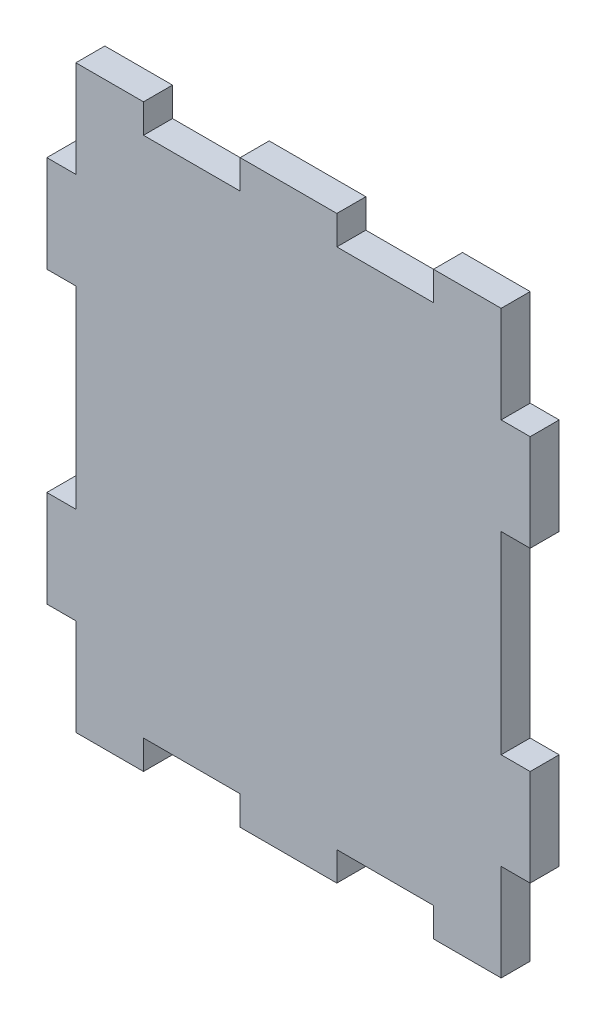
ISO-10303-21;
HEADER;
FILE_DESCRIPTION(('STEP AP214'),'2;1');
FILE_NAME('part.step','',(''),(''),'','','');
FILE_SCHEMA(('AUTOMOTIVE_DESIGN { 1 0 10303 214 1 1 1 1 }'));
ENDSEC;
DATA;
#1=APPLICATION_CONTEXT('core data for automotive mechanical design processes');
#2=APPLICATION_PROTOCOL_DEFINITION('international standard','automotive_design',2000,#1);
#3=PRODUCT_CONTEXT('',#1,'mechanical');
#4=PRODUCT('Part','Part','',(#3));
#5=PRODUCT_RELATED_PRODUCT_CATEGORY('part','',(#4));
#6=PRODUCT_DEFINITION_FORMATION('','',#4);
#7=PRODUCT_DEFINITION_CONTEXT('part definition',#1,'design');
#8=PRODUCT_DEFINITION('design','',#6,#7);
#9=PRODUCT_DEFINITION_SHAPE('','',#8);
#10=(LENGTH_UNIT() NAMED_UNIT(*) SI_UNIT(.MILLI.,.METRE.));
#11=(NAMED_UNIT(*) PLANE_ANGLE_UNIT() SI_UNIT($,.RADIAN.));
#12=(NAMED_UNIT(*) SI_UNIT($,.STERADIAN.) SOLID_ANGLE_UNIT());
#13=UNCERTAINTY_MEASURE_WITH_UNIT(LENGTH_MEASURE(1.E-05),#10,'distance_accuracy_value','');
#14=(GEOMETRIC_REPRESENTATION_CONTEXT(3) GLOBAL_UNCERTAINTY_ASSIGNED_CONTEXT((#13)) GLOBAL_UNIT_ASSIGNED_CONTEXT((#10,
#11,#12)) REPRESENTATION_CONTEXT('',''));
#15=CARTESIAN_POINT('',(0.,0.,0.));
#16=DIRECTION('',(0.,0.,1.));
#17=DIRECTION('',(1.,0.,0.));
#18=AXIS2_PLACEMENT_3D('',#15,#16,#17);
#19=CARTESIAN_POINT('',(25.,-30.,3.));
#20=DIRECTION('',(-1.,0.,0.));
#21=DIRECTION('',(0.,0.,1.));
#22=AXIS2_PLACEMENT_3D('',#19,#20,#21);
#23=PLANE('',#22);
#24=DIRECTION('',(0.,1.,0.));
#25=VECTOR('',#24,1.);
#26=CARTESIAN_POINT('',(25.,-30.,3.));
#27=LINE('',#26,#25);
#28=CARTESIAN_POINT('',(24.9999999999999,-20.,2.99999999999995));
#29=VERTEX_POINT('',#28);
#30=CARTESIAN_POINT('',(24.9999999999999,-10.,2.99999999999992));
#31=VERTEX_POINT('',#30);
#32=EDGE_CURVE('E318',#29,#31,#27,.T.);
#33=ORIENTED_EDGE('',*,*,#32,.F.);
#34=DIRECTION('',(0.,0.,-1.));
#35=VECTOR('',#34,1.);
#36=CARTESIAN_POINT('',(24.9999999999999,-20.0000000000001,0.));
#37=LINE('',#36,#35);
#38=CARTESIAN_POINT('',(24.9999999999999,-20.0000000000001,0.));
#39=VERTEX_POINT('',#38);
#40=EDGE_CURVE('E519',#29,#39,#37,.T.);
#41=ORIENTED_EDGE('',*,*,#40,.T.);
#42=DIRECTION('',(0.,1.,0.));
#43=VECTOR('',#42,1.);
#44=CARTESIAN_POINT('',(25.,-30.,0.));
#45=LINE('',#44,#43);
#46=CARTESIAN_POINT('',(24.9999999999999,-10.,0.));
#47=VERTEX_POINT('',#46);
#48=EDGE_CURVE('E331',#39,#47,#45,.T.);
#49=ORIENTED_EDGE('',*,*,#48,.T.);
#50=DIRECTION('',(0.,0.,1.));
#51=VECTOR('',#50,1.);
#52=CARTESIAN_POINT('',(24.9999999999999,-10.,0.));
#53=LINE('',#52,#51);
#54=EDGE_CURVE('E497',#47,#31,#53,.T.);
#55=ORIENTED_EDGE('',*,*,#54,.T.);
#56=EDGE_LOOP('',(#33,#41,#49,#55));
#57=FACE_BOUND('',#56,.T.);
#58=ADVANCED_FACE('F37',(#57),#23,.F.);
#59=CARTESIAN_POINT('',(-25.,30.,3.));
#60=DIRECTION('',(0.,-1.,0.));
#61=DIRECTION('',(0.,0.,-1.));
#62=AXIS2_PLACEMENT_3D('',#59,#60,#61);
#63=PLANE('',#62);
#64=DIRECTION('',(0.,0.,1.));
#65=VECTOR('',#64,1.);
#66=CARTESIAN_POINT('',(22.0000000000001,30.0000000000001,49.9999999999998));
#67=LINE('',#66,#65);
#68=CARTESIAN_POINT('',(21.9999999999999,29.9999999999999,-2.1163626406917E-13));
#69=VERTEX_POINT('',#68);
#70=CARTESIAN_POINT('',(21.9999999999999,30.,3.));
#71=VERTEX_POINT('',#70);
#72=EDGE_CURVE('E532',#69,#71,#67,.T.);
#73=ORIENTED_EDGE('',*,*,#72,.F.);
#74=DIRECTION('',(-1.,0.,0.));
#75=VECTOR('',#74,1.);
#76=CARTESIAN_POINT('',(-25.,30.,0.));
#77=LINE('',#76,#75);
#78=CARTESIAN_POINT('',(15.,30.,0.));
#79=VERTEX_POINT('',#78);
#80=EDGE_CURVE('E335',#69,#79,#77,.T.);
#81=ORIENTED_EDGE('',*,*,#80,.T.);
#82=DIRECTION('',(0.,0.,-1.));
#83=VECTOR('',#82,1.);
#84=CARTESIAN_POINT('',(15.,30.,0.));
#85=LINE('',#84,#83);
#86=CARTESIAN_POINT('',(15.,30.,3.));
#87=VERTEX_POINT('',#86);
#88=EDGE_CURVE('E381',#87,#79,#85,.T.);
#89=ORIENTED_EDGE('',*,*,#88,.F.);
#90=DIRECTION('',(-1.,0.,0.));
#91=VECTOR('',#90,1.);
#92=CARTESIAN_POINT('',(-25.,30.,3.));
#93=LINE('',#92,#91);
#94=EDGE_CURVE('E323',#71,#87,#93,.T.);
#95=ORIENTED_EDGE('',*,*,#94,.F.);
#96=EDGE_LOOP('',(#73,#81,#89,#95));
#97=FACE_BOUND('',#96,.T.);
#98=ADVANCED_FACE('F537',(#97),#63,.F.);
#99=DIRECTION('',(0.,0.,1.));
#100=VECTOR('',#99,1.);
#101=CARTESIAN_POINT('',(5.,30.,0.));
#102=LINE('',#101,#100);
#103=CARTESIAN_POINT('',(5.,30.,0.));
#104=VERTEX_POINT('',#103);
#105=CARTESIAN_POINT('',(5.,30.,3.));
#106=VERTEX_POINT('',#105);
#107=EDGE_CURVE('E357',#104,#106,#102,.T.);
#108=ORIENTED_EDGE('',*,*,#107,.F.);
#109=CARTESIAN_POINT('',(-5.,30.,0.));
#110=VERTEX_POINT('',#109);
#111=EDGE_CURVE('E334',#104,#110,#77,.T.);
#112=ORIENTED_EDGE('',*,*,#111,.T.);
#113=DIRECTION('',(0.,0.,-1.));
#114=VECTOR('',#113,1.);
#115=CARTESIAN_POINT('',(-5.,30.,0.));
#116=LINE('',#115,#114);
#117=CARTESIAN_POINT('',(-5.,30.,3.));
#118=VERTEX_POINT('',#117);
#119=EDGE_CURVE('E356',#118,#110,#116,.T.);
#120=ORIENTED_EDGE('',*,*,#119,.F.);
#121=EDGE_CURVE('E322',#106,#118,#93,.T.);
#122=ORIENTED_EDGE('',*,*,#121,.F.);
#123=EDGE_LOOP('',(#108,#112,#120,#122));
#124=FACE_BOUND('',#123,.T.);
#125=ADVANCED_FACE('F354',(#124),#63,.F.);
#126=DIRECTION('',(0.,0.,1.));
#127=VECTOR('',#126,1.);
#128=CARTESIAN_POINT('',(-15.,30.,0.));
#129=LINE('',#128,#127);
#130=CARTESIAN_POINT('',(-15.,30.,0.));
#131=VERTEX_POINT('',#130);
#132=CARTESIAN_POINT('',(-15.,30.,3.));
#133=VERTEX_POINT('',#132);
#134=EDGE_CURVE('E279',#131,#133,#129,.T.);
#135=ORIENTED_EDGE('',*,*,#134,.F.);
#136=CARTESIAN_POINT('',(-22.0000000000001,29.9999999999999,0.));
#137=VERTEX_POINT('',#136);
#138=EDGE_CURVE('E332',#131,#137,#77,.T.);
#139=ORIENTED_EDGE('',*,*,#138,.T.);
#140=DIRECTION('',(0.,0.,1.));
#141=VECTOR('',#140,1.);
#142=CARTESIAN_POINT('',(-21.9999999999999,30.0000000000001,49.9999999999999));
#143=LINE('',#142,#141);
#144=CARTESIAN_POINT('',(-22.0000000000001,30.,3.));
#145=VERTEX_POINT('',#144);
#146=EDGE_CURVE('E482',#137,#145,#143,.T.);
#147=ORIENTED_EDGE('',*,*,#146,.T.);
#148=EDGE_CURVE('E320',#133,#145,#93,.T.);
#149=ORIENTED_EDGE('',*,*,#148,.F.);
#150=EDGE_LOOP('',(#135,#139,#147,#149));
#151=FACE_BOUND('',#150,.T.);
#152=ADVANCED_FACE('F547',(#151),#63,.F.);
#153=CARTESIAN_POINT('',(-25.,-30.,3.));
#154=DIRECTION('',(1.,0.,0.));
#155=DIRECTION('',(0.,0.,-1.));
#156=AXIS2_PLACEMENT_3D('',#153,#154,#155);
#157=PLANE('',#156);
#158=DIRECTION('',(0.,0.,1.));
#159=VECTOR('',#158,1.);
#160=CARTESIAN_POINT('',(-25.0000000000001,20.,0.));
#161=LINE('',#160,#159);
#162=CARTESIAN_POINT('',(-25.0000000000001,20.,0.));
#163=VERTEX_POINT('',#162);
#164=CARTESIAN_POINT('',(-25.0000000000001,20.,2.99999999999998));
#165=VERTEX_POINT('',#164);
#166=EDGE_CURVE('E435',#163,#165,#161,.T.);
#167=ORIENTED_EDGE('',*,*,#166,.F.);
#168=DIRECTION('',(0.,-1.,0.));
#169=VECTOR('',#168,1.);
#170=CARTESIAN_POINT('',(-25.,-30.,0.));
#171=LINE('',#170,#169);
#172=CARTESIAN_POINT('',(-25.0000000000001,9.99999999999994,0.));
#173=VERTEX_POINT('',#172);
#174=EDGE_CURVE('E338',#163,#173,#171,.T.);
#175=ORIENTED_EDGE('',*,*,#174,.T.);
#176=DIRECTION('',(0.,0.,-1.));
#177=VECTOR('',#176,1.);
#178=CARTESIAN_POINT('',(-25.0000000000001,9.99999999999994,0.));
#179=LINE('',#178,#177);
#180=CARTESIAN_POINT('',(-25.0000000000001,9.99999999999996,3.00000000000001));
#181=VERTEX_POINT('',#180);
#182=EDGE_CURVE('E437',#181,#173,#179,.T.);
#183=ORIENTED_EDGE('',*,*,#182,.F.);
#184=DIRECTION('',(0.,-1.,0.));
#185=VECTOR('',#184,1.);
#186=CARTESIAN_POINT('',(-25.,-30.,3.));
#187=LINE('',#186,#185);
#188=EDGE_CURVE('E326',#165,#181,#187,.T.);
#189=ORIENTED_EDGE('',*,*,#188,.F.);
#190=EDGE_LOOP('',(#167,#175,#183,#189));
#191=FACE_BOUND('',#190,.T.);
#192=ADVANCED_FACE('F560',(#191),#157,.F.);
#193=DIRECTION('',(0.,0.,1.));
#194=VECTOR('',#193,1.);
#195=CARTESIAN_POINT('',(-25.0000000000001,-10.,0.));
#196=LINE('',#195,#194);
#197=CARTESIAN_POINT('',(-25.0000000000001,-10.,0.));
#198=VERTEX_POINT('',#197);
#199=CARTESIAN_POINT('',(-25.0000000000001,-10.,3.00000000000008));
#200=VERTEX_POINT('',#199);
#201=EDGE_CURVE('E471',#198,#200,#196,.T.);
#202=ORIENTED_EDGE('',*,*,#201,.F.);
#203=CARTESIAN_POINT('',(-25.0000000000001,-20.,1.14491749414469E-13));
#204=VERTEX_POINT('',#203);
#205=EDGE_CURVE('E336',#198,#204,#171,.T.);
#206=ORIENTED_EDGE('',*,*,#205,.T.);
#207=DIRECTION('',(0.,0.,-1.));
#208=VECTOR('',#207,1.);
#209=CARTESIAN_POINT('',(-25.0000000000001,-20.,1.14491749414469E-13));
#210=LINE('',#209,#208);
#211=CARTESIAN_POINT('',(-25.0000000000001,-20.,3.00000000000011));
#212=VERTEX_POINT('',#211);
#213=EDGE_CURVE('E459',#212,#204,#210,.T.);
#214=ORIENTED_EDGE('',*,*,#213,.F.);
#215=EDGE_CURVE('E324',#200,#212,#187,.T.);
#216=ORIENTED_EDGE('',*,*,#215,.F.);
#217=EDGE_LOOP('',(#202,#206,#214,#216));
#218=FACE_BOUND('',#217,.T.);
#219=ADVANCED_FACE('F581',(#218),#157,.F.);
#220=CARTESIAN_POINT('',(-25.,-30.,3.));
#221=DIRECTION('',(0.,1.,0.));
#222=DIRECTION('',(0.,0.,1.));
#223=AXIS2_PLACEMENT_3D('',#220,#221,#222);
#224=PLANE('',#223);
#225=DIRECTION('',(1.,0.,0.));
#226=VECTOR('',#225,1.);
#227=CARTESIAN_POINT('',(-25.,-30.,3.));
#228=LINE('',#227,#226);
#229=CARTESIAN_POINT('',(-22.0000000000001,-30.,3.));
#230=VERTEX_POINT('',#229);
#231=CARTESIAN_POINT('',(-15.,-30.,3.));
#232=VERTEX_POINT('',#231);
#233=EDGE_CURVE('E11',#230,#232,#228,.T.);
#234=ORIENTED_EDGE('',*,*,#233,.F.);
#235=DIRECTION('',(0.,0.,-1.));
#236=VECTOR('',#235,1.);
#237=CARTESIAN_POINT('',(-21.9999999999999,-29.9999999999999,50.0000000000001));
#238=LINE('',#237,#236);
#239=CARTESIAN_POINT('',(-22.0000000000001,-30.,1.38777878078145E-13));
#240=VERTEX_POINT('',#239);
#241=EDGE_CURVE('E450',#230,#240,#238,.T.);
#242=ORIENTED_EDGE('',*,*,#241,.T.);
#243=DIRECTION('',(1.,0.,0.));
#244=VECTOR('',#243,1.);
#245=CARTESIAN_POINT('',(-25.,-30.,0.));
#246=LINE('',#245,#244);
#247=CARTESIAN_POINT('',(-15.,-30.,0.));
#248=VERTEX_POINT('',#247);
#249=EDGE_CURVE('E319',#240,#248,#246,.T.);
#250=ORIENTED_EDGE('',*,*,#249,.T.);
#251=DIRECTION('',(0.,0.,1.));
#252=VECTOR('',#251,1.);
#253=CARTESIAN_POINT('',(-15.,-30.,0.));
#254=LINE('',#253,#252);
#255=EDGE_CURVE('E396',#248,#232,#254,.T.);
#256=ORIENTED_EDGE('',*,*,#255,.T.);
#257=EDGE_LOOP('',(#234,#242,#250,#256));
#258=FACE_BOUND('',#257,.T.);
#259=ADVANCED_FACE('F585',(#258),#224,.F.);
#260=CARTESIAN_POINT('',(-5.,-30.,3.));
#261=VERTEX_POINT('',#260);
#262=CARTESIAN_POINT('',(5.,-30.,3.));
#263=VERTEX_POINT('',#262);
#264=EDGE_CURVE('E46',#261,#263,#228,.T.);
#265=ORIENTED_EDGE('',*,*,#264,.F.);
#266=DIRECTION('',(0.,0.,-1.));
#267=VECTOR('',#266,1.);
#268=CARTESIAN_POINT('',(-5.,-30.,0.));
#269=LINE('',#268,#267);
#270=CARTESIAN_POINT('',(-5.,-30.,0.));
#271=VERTEX_POINT('',#270);
#272=EDGE_CURVE('E413',#261,#271,#269,.T.);
#273=ORIENTED_EDGE('',*,*,#272,.T.);
#274=CARTESIAN_POINT('',(5.,-30.,0.));
#275=VERTEX_POINT('',#274);
#276=EDGE_CURVE('E599',#271,#275,#246,.T.);
#277=ORIENTED_EDGE('',*,*,#276,.T.);
#278=DIRECTION('',(0.,0.,1.));
#279=VECTOR('',#278,1.);
#280=CARTESIAN_POINT('',(5.,-30.,0.));
#281=LINE('',#280,#279);
#282=EDGE_CURVE('E395',#275,#263,#281,.T.);
#283=ORIENTED_EDGE('',*,*,#282,.T.);
#284=EDGE_LOOP('',(#265,#273,#277,#283));
#285=FACE_BOUND('',#284,.T.);
#286=ADVANCED_FACE('F604',(#285),#224,.F.);
#287=CARTESIAN_POINT('',(15.,-30.,3.));
#288=VERTEX_POINT('',#287);
#289=CARTESIAN_POINT('',(21.9999999999999,-30.,3.));
#290=VERTEX_POINT('',#289);
#291=EDGE_CURVE('E48',#288,#290,#228,.T.);
#292=ORIENTED_EDGE('',*,*,#291,.F.);
#293=DIRECTION('',(0.,0.,-1.));
#294=VECTOR('',#293,1.);
#295=CARTESIAN_POINT('',(15.,-30.,0.));
#296=LINE('',#295,#294);
#297=CARTESIAN_POINT('',(15.,-30.,0.));
#298=VERTEX_POINT('',#297);
#299=EDGE_CURVE('E427',#288,#298,#296,.T.);
#300=ORIENTED_EDGE('',*,*,#299,.T.);
#301=CARTESIAN_POINT('',(21.9999999999999,-30.0000000000001,0.));
#302=VERTEX_POINT('',#301);
#303=EDGE_CURVE('E41',#298,#302,#246,.T.);
#304=ORIENTED_EDGE('',*,*,#303,.T.);
#305=DIRECTION('',(0.,0.,-1.));
#306=VECTOR('',#305,1.);
#307=CARTESIAN_POINT('',(22.0000000000001,-29.9999999999999,50.));
#308=LINE('',#307,#306);
#309=EDGE_CURVE('E503',#290,#302,#308,.T.);
#310=ORIENTED_EDGE('',*,*,#309,.F.);
#311=EDGE_LOOP('',(#292,#300,#304,#310));
#312=FACE_BOUND('',#311,.T.);
#313=ADVANCED_FACE('F622',(#312),#224,.F.);
#314=CARTESIAN_POINT('',(0.,0.,0.));
#315=DIRECTION('',(0.,0.,-1.));
#316=DIRECTION('',(-1.,0.,0.));
#317=AXIS2_PLACEMENT_3D('',#314,#315,#316);
#318=PLANE('',#317);
#319=DIRECTION('',(0.,1.,0.));
#320=VECTOR('',#319,1.);
#321=CARTESIAN_POINT('',(21.9999999999999,29.9999999999999,-2.1163626406917E-13));
#322=LINE('',#321,#320);
#323=CARTESIAN_POINT('',(21.9999999999999,19.9999999999999,-1.76941794549634E-13));
#324=VERTEX_POINT('',#323);
#325=EDGE_CURVE('E529',#324,#69,#322,.T.);
#326=ORIENTED_EDGE('',*,*,#325,.F.);
#327=DIRECTION('',(1.,0.,0.));
#328=VECTOR('',#327,1.);
#329=CARTESIAN_POINT('',(21.9999999999999,19.9999999999999,-1.76941794549634E-13));
#330=LINE('',#329,#328);
#331=CARTESIAN_POINT('',(24.9999999999999,19.9999999999999,-1.87350135405495E-13));
#332=VERTEX_POINT('',#331);
#333=EDGE_CURVE('E500',#324,#332,#330,.T.);
#334=ORIENTED_EDGE('',*,*,#333,.T.);
#335=CARTESIAN_POINT('',(24.9999999999999,9.99999999999994,-1.52655665885959E-13));
#336=VERTEX_POINT('',#335);
#337=EDGE_CURVE('E328',#336,#332,#45,.T.);
#338=ORIENTED_EDGE('',*,*,#337,.F.);
#339=DIRECTION('',(1.,0.,0.));
#340=VECTOR('',#339,1.);
#341=CARTESIAN_POINT('',(21.9999999999999,9.99999999999994,-1.42247325030098E-13));
#342=LINE('',#341,#340);
#343=CARTESIAN_POINT('',(21.9999999999999,9.99999999999994,-1.42247325030098E-13));
#344=VERTEX_POINT('',#343);
#345=EDGE_CURVE('E504',#344,#336,#342,.T.);
#346=ORIENTED_EDGE('',*,*,#345,.F.);
#347=CARTESIAN_POINT('',(21.9999999999999,-10.,0.));
#348=VERTEX_POINT('',#347);
#349=EDGE_CURVE('E533',#348,#344,#322,.T.);
#350=ORIENTED_EDGE('',*,*,#349,.F.);
#351=DIRECTION('',(1.,0.,0.));
#352=VECTOR('',#351,1.);
#353=CARTESIAN_POINT('',(21.9999999999999,-10.,0.));
#354=LINE('',#353,#352);
#355=EDGE_CURVE('E486',#348,#47,#354,.T.);
#356=ORIENTED_EDGE('',*,*,#355,.T.);
#357=ORIENTED_EDGE('',*,*,#48,.F.);
#358=DIRECTION('',(1.,0.,0.));
#359=VECTOR('',#358,1.);
#360=CARTESIAN_POINT('',(21.9999999999999,-20.0000000000001,0.));
#361=LINE('',#360,#359);
#362=CARTESIAN_POINT('',(21.9999999999999,-20.0000000000001,0.));
#363=VERTEX_POINT('',#362);
#364=EDGE_CURVE('E515',#363,#39,#361,.T.);
#365=ORIENTED_EDGE('',*,*,#364,.F.);
#366=EDGE_CURVE('E530',#302,#363,#322,.T.);
#367=ORIENTED_EDGE('',*,*,#366,.F.);
#368=ORIENTED_EDGE('',*,*,#303,.F.);
#369=DIRECTION('',(0.,-1.,0.));
#370=VECTOR('',#369,1.);
#371=CARTESIAN_POINT('',(15.,-27.,0.));
#372=LINE('',#371,#370);
#373=CARTESIAN_POINT('',(15.,-27.,0.));
#374=VERTEX_POINT('',#373);
#375=EDGE_CURVE('E399',#374,#298,#372,.T.);
#376=ORIENTED_EDGE('',*,*,#375,.F.);
#377=DIRECTION('',(1.,0.,0.));
#378=VECTOR('',#377,1.);
#379=CARTESIAN_POINT('',(-25.,-27.,0.));
#380=LINE('',#379,#378);
#381=CARTESIAN_POINT('',(5.,-27.,0.));
#382=VERTEX_POINT('',#381);
#383=EDGE_CURVE('E430',#382,#374,#380,.T.);
#384=ORIENTED_EDGE('',*,*,#383,.F.);
#385=DIRECTION('',(0.,-1.,0.));
#386=VECTOR('',#385,1.);
#387=CARTESIAN_POINT('',(5.,-27.,0.));
#388=LINE('',#387,#386);
#389=EDGE_CURVE('E402',#382,#275,#388,.T.);
#390=ORIENTED_EDGE('',*,*,#389,.T.);
#391=ORIENTED_EDGE('',*,*,#276,.F.);
#392=DIRECTION('',(0.,-1.,0.));
#393=VECTOR('',#392,1.);
#394=CARTESIAN_POINT('',(-5.,-27.,0.));
#395=LINE('',#394,#393);
#396=CARTESIAN_POINT('',(-5.,-27.,0.));
#397=VERTEX_POINT('',#396);
#398=EDGE_CURVE('E411',#397,#271,#395,.T.);
#399=ORIENTED_EDGE('',*,*,#398,.F.);
#400=CARTESIAN_POINT('',(-15.,-27.,0.));
#401=VERTEX_POINT('',#400);
#402=EDGE_CURVE('E434',#401,#397,#380,.T.);
#403=ORIENTED_EDGE('',*,*,#402,.F.);
#404=DIRECTION('',(0.,-1.,0.));
#405=VECTOR('',#404,1.);
#406=CARTESIAN_POINT('',(-15.,-27.,0.));
#407=LINE('',#406,#405);
#408=EDGE_CURVE('E389',#401,#248,#407,.T.);
#409=ORIENTED_EDGE('',*,*,#408,.T.);
#410=ORIENTED_EDGE('',*,*,#249,.F.);
#411=DIRECTION('',(0.,1.,0.));
#412=VECTOR('',#411,1.);
#413=CARTESIAN_POINT('',(-22.0000000000001,29.9999999999999,0.));
#414=LINE('',#413,#412);
#415=CARTESIAN_POINT('',(-22.0000000000001,-20.,1.04083408558608E-13));
#416=VERTEX_POINT('',#415);
#417=EDGE_CURVE('E479',#240,#416,#414,.T.);
#418=ORIENTED_EDGE('',*,*,#417,.T.);
#419=DIRECTION('',(1.,0.,0.));
#420=VECTOR('',#419,1.);
#421=CARTESIAN_POINT('',(-25.0000000000001,-20.,1.14491749414469E-13));
#422=LINE('',#421,#420);
#423=EDGE_CURVE('E463',#204,#416,#422,.T.);
#424=ORIENTED_EDGE('',*,*,#423,.F.);
#425=ORIENTED_EDGE('',*,*,#205,.F.);
#426=DIRECTION('',(1.,0.,0.));
#427=VECTOR('',#426,1.);
#428=CARTESIAN_POINT('',(-25.0000000000001,-10.,0.));
#429=LINE('',#428,#427);
#430=CARTESIAN_POINT('',(-22.0000000000001,-10.,0.));
#431=VERTEX_POINT('',#430);
#432=EDGE_CURVE('E466',#198,#431,#429,.T.);
#433=ORIENTED_EDGE('',*,*,#432,.T.);
#434=CARTESIAN_POINT('',(-22.0000000000001,9.99999999999994,0.));
#435=VERTEX_POINT('',#434);
#436=EDGE_CURVE('E483',#431,#435,#414,.T.);
#437=ORIENTED_EDGE('',*,*,#436,.T.);
#438=DIRECTION('',(1.,0.,0.));
#439=VECTOR('',#438,1.);
#440=CARTESIAN_POINT('',(-25.0000000000001,9.99999999999994,0.));
#441=LINE('',#440,#439);
#442=EDGE_CURVE('E451',#173,#435,#441,.T.);
#443=ORIENTED_EDGE('',*,*,#442,.F.);
#444=ORIENTED_EDGE('',*,*,#174,.F.);
#445=DIRECTION('',(1.,0.,0.));
#446=VECTOR('',#445,1.);
#447=CARTESIAN_POINT('',(-25.0000000000001,20.,0.));
#448=LINE('',#447,#446);
#449=CARTESIAN_POINT('',(-22.0000000000001,20.,0.));
#450=VERTEX_POINT('',#449);
#451=EDGE_CURVE('E447',#163,#450,#448,.T.);
#452=ORIENTED_EDGE('',*,*,#451,.T.);
#453=EDGE_CURVE('E478',#450,#137,#414,.T.);
#454=ORIENTED_EDGE('',*,*,#453,.T.);
#455=ORIENTED_EDGE('',*,*,#138,.F.);
#456=DIRECTION('',(0.,-1.,0.));
#457=VECTOR('',#456,1.);
#458=CARTESIAN_POINT('',(-15.,30.,0.));
#459=LINE('',#458,#457);
#460=CARTESIAN_POINT('',(-15.,27.,0.));
#461=VERTEX_POINT('',#460);
#462=EDGE_CURVE('E283',#131,#461,#459,.T.);
#463=ORIENTED_EDGE('',*,*,#462,.T.);
#464=DIRECTION('',(1.,0.,0.));
#465=VECTOR('',#464,1.);
#466=CARTESIAN_POINT('',(-25.,27.,0.));
#467=LINE('',#466,#465);
#468=CARTESIAN_POINT('',(-5.,27.,0.));
#469=VERTEX_POINT('',#468);
#470=EDGE_CURVE('E292',#461,#469,#467,.T.);
#471=ORIENTED_EDGE('',*,*,#470,.T.);
#472=DIRECTION('',(0.,-1.,0.));
#473=VECTOR('',#472,1.);
#474=CARTESIAN_POINT('',(-5.,30.,0.));
#475=LINE('',#474,#473);
#476=EDGE_CURVE('E365',#110,#469,#475,.T.);
#477=ORIENTED_EDGE('',*,*,#476,.F.);
#478=ORIENTED_EDGE('',*,*,#111,.F.);
#479=DIRECTION('',(0.,-1.,0.));
#480=VECTOR('',#479,1.);
#481=CARTESIAN_POINT('',(5.,30.,0.));
#482=LINE('',#481,#480);
#483=CARTESIAN_POINT('',(5.,27.,0.));
#484=VERTEX_POINT('',#483);
#485=EDGE_CURVE('E364',#104,#484,#482,.T.);
#486=ORIENTED_EDGE('',*,*,#485,.T.);
#487=CARTESIAN_POINT('',(15.,27.,0.));
#488=VERTEX_POINT('',#487);
#489=EDGE_CURVE('E386',#484,#488,#467,.T.);
#490=ORIENTED_EDGE('',*,*,#489,.T.);
#491=DIRECTION('',(0.,-1.,0.));
#492=VECTOR('',#491,1.);
#493=CARTESIAN_POINT('',(15.,30.,0.));
#494=LINE('',#493,#492);
#495=EDGE_CURVE('E294',#79,#488,#494,.T.);
#496=ORIENTED_EDGE('',*,*,#495,.F.);
#497=ORIENTED_EDGE('',*,*,#80,.F.);
#498=EDGE_LOOP('',(#326,#334,#338,#346,#350,#356,#357,#365,#367,#368,#376,#384,#390,#391,#399,
#403,#409,#410,#418,#424,#425,#433,#437,#443,#444,#452,#454,#455,#463,#471,#477,#478,#486,#490,
#496,#497));
#499=FACE_BOUND('',#498,.T.);
#500=ADVANCED_FACE('F362',(#499),#318,.T.);
#501=CARTESIAN_POINT('',(24.9999999999999,9.99999999999995,2.99999999999985));
#502=VERTEX_POINT('',#501);
#503=CARTESIAN_POINT('',(24.9999999999999,20.,2.99999999999981));
#504=VERTEX_POINT('',#503);
#505=EDGE_CURVE('E315',#502,#504,#27,.T.);
#506=ORIENTED_EDGE('',*,*,#505,.F.);
#507=DIRECTION('',(0.,0.,-1.));
#508=VECTOR('',#507,1.);
#509=CARTESIAN_POINT('',(24.9999999999999,9.99999999999994,-1.52655665885959E-13));
#510=LINE('',#509,#508);
#511=EDGE_CURVE('E491',#502,#336,#510,.T.);
#512=ORIENTED_EDGE('',*,*,#511,.T.);
#513=ORIENTED_EDGE('',*,*,#337,.T.);
#514=DIRECTION('',(0.,0.,1.));
#515=VECTOR('',#514,1.);
#516=CARTESIAN_POINT('',(24.9999999999999,19.9999999999999,-1.87350135405495E-13));
#517=LINE('',#516,#515);
#518=EDGE_CURVE('E494',#332,#504,#517,.T.);
#519=ORIENTED_EDGE('',*,*,#518,.T.);
#520=EDGE_LOOP('',(#506,#512,#513,#519));
#521=FACE_BOUND('',#520,.T.);
#522=ADVANCED_FACE('F39',(#521),#23,.F.);
#523=CARTESIAN_POINT('',(0.,0.,3.));
#524=DIRECTION('',(0.,0.,-1.));
#525=DIRECTION('',(-1.,0.,0.));
#526=AXIS2_PLACEMENT_3D('',#523,#524,#525);
#527=PLANE('',#526);
#528=ORIENTED_EDGE('',*,*,#94,.T.);
#529=DIRECTION('',(0.,-1.,0.));
#530=VECTOR('',#529,1.);
#531=CARTESIAN_POINT('',(15.,30.,3.));
#532=LINE('',#531,#530);
#533=CARTESIAN_POINT('',(15.,27.,3.));
#534=VERTEX_POINT('',#533);
#535=EDGE_CURVE('E378',#87,#534,#532,.T.);
#536=ORIENTED_EDGE('',*,*,#535,.T.);
#537=DIRECTION('',(1.,0.,0.));
#538=VECTOR('',#537,1.);
#539=CARTESIAN_POINT('',(0.,27.,3.));
#540=LINE('',#539,#538);
#541=CARTESIAN_POINT('',(5.,27.,3.));
#542=VERTEX_POINT('',#541);
#543=EDGE_CURVE('E301',#542,#534,#540,.T.);
#544=ORIENTED_EDGE('',*,*,#543,.F.);
#545=DIRECTION('',(0.,-1.,0.));
#546=VECTOR('',#545,1.);
#547=CARTESIAN_POINT('',(5.,30.,3.));
#548=LINE('',#547,#546);
#549=EDGE_CURVE('E368',#106,#542,#548,.T.);
#550=ORIENTED_EDGE('',*,*,#549,.F.);
#551=ORIENTED_EDGE('',*,*,#121,.T.);
#552=DIRECTION('',(0.,-1.,0.));
#553=VECTOR('',#552,1.);
#554=CARTESIAN_POINT('',(-5.,30.,3.));
#555=LINE('',#554,#553);
#556=CARTESIAN_POINT('',(-5.,27.,3.));
#557=VERTEX_POINT('',#556);
#558=EDGE_CURVE('E299',#118,#557,#555,.T.);
#559=ORIENTED_EDGE('',*,*,#558,.T.);
#560=CARTESIAN_POINT('',(-15.,27.,3.));
#561=VERTEX_POINT('',#560);
#562=EDGE_CURVE('E289',#561,#557,#540,.T.);
#563=ORIENTED_EDGE('',*,*,#562,.F.);
#564=DIRECTION('',(0.,-1.,0.));
#565=VECTOR('',#564,1.);
#566=CARTESIAN_POINT('',(-15.,30.,3.));
#567=LINE('',#566,#565);
#568=EDGE_CURVE('E273',#133,#561,#567,.T.);
#569=ORIENTED_EDGE('',*,*,#568,.F.);
#570=ORIENTED_EDGE('',*,*,#148,.T.);
#571=DIRECTION('',(0.,1.,0.));
#572=VECTOR('',#571,1.);
#573=CARTESIAN_POINT('',(-22.0000000000001,0.,3.));
#574=LINE('',#573,#572);
#575=CARTESIAN_POINT('',(-22.0000000000001,20.,2.99999999999996));
#576=VERTEX_POINT('',#575);
#577=EDGE_CURVE('E309',#576,#145,#574,.T.);
#578=ORIENTED_EDGE('',*,*,#577,.F.);
#579=DIRECTION('',(1.,0.,0.));
#580=VECTOR('',#579,1.);
#581=CARTESIAN_POINT('',(-25.0000000000001,20.,2.99999999999998));
#582=LINE('',#581,#580);
#583=EDGE_CURVE('E440',#165,#576,#582,.T.);
#584=ORIENTED_EDGE('',*,*,#583,.F.);
#585=ORIENTED_EDGE('',*,*,#188,.T.);
#586=DIRECTION('',(1.,0.,0.));
#587=VECTOR('',#586,1.);
#588=CARTESIAN_POINT('',(-25.0000000000001,9.99999999999996,3.00000000000001));
#589=LINE('',#588,#587);
#590=CARTESIAN_POINT('',(-22.0000000000001,9.99999999999996,3.));
#591=VERTEX_POINT('',#590);
#592=EDGE_CURVE('E453',#181,#591,#589,.T.);
#593=ORIENTED_EDGE('',*,*,#592,.T.);
#594=CARTESIAN_POINT('',(-22.0000000000001,-10.,3.00000000000007));
#595=VERTEX_POINT('',#594);
#596=EDGE_CURVE('E311',#595,#591,#574,.T.);
#597=ORIENTED_EDGE('',*,*,#596,.F.);
#598=DIRECTION('',(1.,0.,0.));
#599=VECTOR('',#598,1.);
#600=CARTESIAN_POINT('',(-25.0000000000001,-10.,3.00000000000008));
#601=LINE('',#600,#599);
#602=EDGE_CURVE('E457',#200,#595,#601,.T.);
#603=ORIENTED_EDGE('',*,*,#602,.F.);
#604=ORIENTED_EDGE('',*,*,#215,.T.);
#605=DIRECTION('',(1.,0.,0.));
#606=VECTOR('',#605,1.);
#607=CARTESIAN_POINT('',(-25.0000000000001,-20.,3.00000000000011));
#608=LINE('',#607,#606);
#609=CARTESIAN_POINT('',(-22.0000000000001,-20.,3.0000000000001));
#610=VERTEX_POINT('',#609);
#611=EDGE_CURVE('E460',#212,#610,#608,.T.);
#612=ORIENTED_EDGE('',*,*,#611,.T.);
#613=EDGE_CURVE('E312',#230,#610,#574,.T.);
#614=ORIENTED_EDGE('',*,*,#613,.F.);
#615=ORIENTED_EDGE('',*,*,#233,.T.);
#616=DIRECTION('',(0.,-1.,0.));
#617=VECTOR('',#616,1.);
#618=CARTESIAN_POINT('',(-15.,-27.,3.));
#619=LINE('',#618,#617);
#620=CARTESIAN_POINT('',(-15.,-27.,3.));
#621=VERTEX_POINT('',#620);
#622=EDGE_CURVE('E393',#621,#232,#619,.T.);
#623=ORIENTED_EDGE('',*,*,#622,.F.);
#624=DIRECTION('',(1.,0.,0.));
#625=VECTOR('',#624,1.);
#626=CARTESIAN_POINT('',(0.,-27.,3.));
#627=LINE('',#626,#625);
#628=CARTESIAN_POINT('',(-5.,-27.,3.));
#629=VERTEX_POINT('',#628);
#630=EDGE_CURVE('E304',#621,#629,#627,.T.);
#631=ORIENTED_EDGE('',*,*,#630,.T.);
#632=DIRECTION('',(0.,-1.,0.));
#633=VECTOR('',#632,1.);
#634=CARTESIAN_POINT('',(-5.,-27.,3.));
#635=LINE('',#634,#633);
#636=EDGE_CURVE('E408',#629,#261,#635,.T.);
#637=ORIENTED_EDGE('',*,*,#636,.T.);
#638=ORIENTED_EDGE('',*,*,#264,.T.);
#639=DIRECTION('',(0.,-1.,0.));
#640=VECTOR('',#639,1.);
#641=CARTESIAN_POINT('',(5.,-27.,3.));
#642=LINE('',#641,#640);
#643=CARTESIAN_POINT('',(5.,-27.,3.));
#644=VERTEX_POINT('',#643);
#645=EDGE_CURVE('E406',#644,#263,#642,.T.);
#646=ORIENTED_EDGE('',*,*,#645,.F.);
#647=CARTESIAN_POINT('',(15.,-27.,3.));
#648=VERTEX_POINT('',#647);
#649=EDGE_CURVE('E300',#644,#648,#627,.T.);
#650=ORIENTED_EDGE('',*,*,#649,.T.);
#651=DIRECTION('',(0.,-1.,0.));
#652=VECTOR('',#651,1.);
#653=CARTESIAN_POINT('',(15.,-27.,3.));
#654=LINE('',#653,#652);
#655=EDGE_CURVE('E422',#648,#288,#654,.T.);
#656=ORIENTED_EDGE('',*,*,#655,.T.);
#657=ORIENTED_EDGE('',*,*,#291,.T.);
#658=DIRECTION('',(0.,1.,0.));
#659=VECTOR('',#658,1.);
#660=CARTESIAN_POINT('',(21.9999999999999,0.,3.));
#661=LINE('',#660,#659);
#662=CARTESIAN_POINT('',(21.9999999999999,-20.,3.));
#663=VERTEX_POINT('',#662);
#664=EDGE_CURVE('E55',#290,#663,#661,.T.);
#665=ORIENTED_EDGE('',*,*,#664,.T.);
#666=DIRECTION('',(1.,0.,0.));
#667=VECTOR('',#666,1.);
#668=CARTESIAN_POINT('',(21.9999999999999,-20.,2.99999999999996));
#669=LINE('',#668,#667);
#670=EDGE_CURVE('E513',#663,#29,#669,.T.);
#671=ORIENTED_EDGE('',*,*,#670,.T.);
#672=ORIENTED_EDGE('',*,*,#32,.T.);
#673=DIRECTION('',(1.,0.,0.));
#674=VECTOR('',#673,1.);
#675=CARTESIAN_POINT('',(21.9999999999999,-10.,2.99999999999993));
#676=LINE('',#675,#674);
#677=CARTESIAN_POINT('',(21.9999999999999,-10.,2.99999999999993));
#678=VERTEX_POINT('',#677);
#679=EDGE_CURVE('E510',#678,#31,#676,.T.);
#680=ORIENTED_EDGE('',*,*,#679,.F.);
#681=DIRECTION('',(0.,1.,0.));
#682=VECTOR('',#681,1.);
#683=CARTESIAN_POINT('',(21.9999999999999,0.,3.));
#684=LINE('',#683,#682);
#685=CARTESIAN_POINT('',(21.9999999999999,9.99999999999995,2.99999999999986));
#686=VERTEX_POINT('',#685);
#687=EDGE_CURVE('E314',#678,#686,#684,.T.);
#688=ORIENTED_EDGE('',*,*,#687,.T.);
#689=DIRECTION('',(1.,0.,0.));
#690=VECTOR('',#689,1.);
#691=CARTESIAN_POINT('',(21.9999999999999,9.99999999999995,2.99999999999986));
#692=LINE('',#691,#690);
#693=EDGE_CURVE('E506',#686,#502,#692,.T.);
#694=ORIENTED_EDGE('',*,*,#693,.T.);
#695=ORIENTED_EDGE('',*,*,#505,.T.);
#696=DIRECTION('',(1.,0.,0.));
#697=VECTOR('',#696,1.);
#698=CARTESIAN_POINT('',(21.9999999999999,20.,2.99999999999982));
#699=LINE('',#698,#697);
#700=CARTESIAN_POINT('',(21.9999999999999,20.,2.99999999999982));
#701=VERTEX_POINT('',#700);
#702=EDGE_CURVE('E493',#701,#504,#699,.T.);
#703=ORIENTED_EDGE('',*,*,#702,.F.);
#704=EDGE_CURVE('E62',#701,#71,#684,.T.);
#705=ORIENTED_EDGE('',*,*,#704,.T.);
#706=EDGE_LOOP('',(#528,#536,#544,#550,#551,#559,#563,#569,#570,#578,#584,#585,#593,#597,#603,
#604,#612,#614,#615,#623,#631,#637,#638,#646,#650,#656,#657,#665,#671,#672,#680,#688,#694,#695,
#703,#705));
#707=FACE_BOUND('',#706,.T.);
#708=ADVANCED_FACE('F297',(#707),#527,.F.);
#709=CARTESIAN_POINT('',(0.,27.,25.));
#710=DIRECTION('',(0.,1.,0.));
#711=DIRECTION('',(0.,0.,1.));
#712=AXIS2_PLACEMENT_3D('',#709,#710,#711);
#713=PLANE('',#712);
#714=ORIENTED_EDGE('',*,*,#543,.T.);
#715=DIRECTION('',(0.,0.,-1.));
#716=VECTOR('',#715,1.);
#717=CARTESIAN_POINT('',(15.,27.,0.));
#718=LINE('',#717,#716);
#719=EDGE_CURVE('E383',#534,#488,#718,.T.);
#720=ORIENTED_EDGE('',*,*,#719,.T.);
#721=ORIENTED_EDGE('',*,*,#489,.F.);
#722=DIRECTION('',(0.,0.,1.));
#723=VECTOR('',#722,1.);
#724=CARTESIAN_POINT('',(5.,27.,0.));
#725=LINE('',#724,#723);
#726=EDGE_CURVE('E284',#484,#542,#725,.T.);
#727=ORIENTED_EDGE('',*,*,#726,.T.);
#728=EDGE_LOOP('',(#714,#720,#721,#727));
#729=FACE_BOUND('',#728,.T.);
#730=ADVANCED_FACE('F660',(#729),#713,.T.);
#731=CARTESIAN_POINT('',(5.,30.,0.));
#732=DIRECTION('',(1.,0.,0.));
#733=DIRECTION('',(0.,-1.,0.));
#734=AXIS2_PLACEMENT_3D('',#731,#732,#733);
#735=PLANE('',#734);
#736=ORIENTED_EDGE('',*,*,#726,.F.);
#737=ORIENTED_EDGE('',*,*,#485,.F.);
#738=ORIENTED_EDGE('',*,*,#107,.T.);
#739=ORIENTED_EDGE('',*,*,#549,.T.);
#740=EDGE_LOOP('',(#736,#737,#738,#739));
#741=FACE_BOUND('',#740,.T.);
#742=ADVANCED_FACE('F661',(#741),#735,.T.);
#743=CARTESIAN_POINT('',(15.,30.,0.));
#744=DIRECTION('',(-1.,0.,0.));
#745=DIRECTION('',(0.,1.,0.));
#746=AXIS2_PLACEMENT_3D('',#743,#744,#745);
#747=PLANE('',#746);
#748=ORIENTED_EDGE('',*,*,#719,.F.);
#749=ORIENTED_EDGE('',*,*,#535,.F.);
#750=ORIENTED_EDGE('',*,*,#88,.T.);
#751=ORIENTED_EDGE('',*,*,#495,.T.);
#752=EDGE_LOOP('',(#748,#749,#750,#751));
#753=FACE_BOUND('',#752,.T.);
#754=ADVANCED_FACE('F658',(#753),#747,.T.);
#755=ORIENTED_EDGE('',*,*,#562,.T.);
#756=DIRECTION('',(0.,0.,-1.));
#757=VECTOR('',#756,1.);
#758=CARTESIAN_POINT('',(-5.,27.,0.));
#759=LINE('',#758,#757);
#760=EDGE_CURVE('E372',#557,#469,#759,.T.);
#761=ORIENTED_EDGE('',*,*,#760,.T.);
#762=ORIENTED_EDGE('',*,*,#470,.F.);
#763=DIRECTION('',(0.,0.,1.));
#764=VECTOR('',#763,1.);
#765=CARTESIAN_POINT('',(-15.,27.,0.));
#766=LINE('',#765,#764);
#767=EDGE_CURVE('E276',#461,#561,#766,.T.);
#768=ORIENTED_EDGE('',*,*,#767,.T.);
#769=EDGE_LOOP('',(#755,#761,#762,#768));
#770=FACE_BOUND('',#769,.T.);
#771=ADVANCED_FACE('F287',(#770),#713,.T.);
#772=CARTESIAN_POINT('',(-5.,30.,0.));
#773=DIRECTION('',(-1.,0.,0.));
#774=DIRECTION('',(0.,1.,0.));
#775=AXIS2_PLACEMENT_3D('',#772,#773,#774);
#776=PLANE('',#775);
#777=ORIENTED_EDGE('',*,*,#760,.F.);
#778=ORIENTED_EDGE('',*,*,#558,.F.);
#779=ORIENTED_EDGE('',*,*,#119,.T.);
#780=ORIENTED_EDGE('',*,*,#476,.T.);
#781=EDGE_LOOP('',(#777,#778,#779,#780));
#782=FACE_BOUND('',#781,.T.);
#783=ADVANCED_FACE('F794',(#782),#776,.T.);
#784=CARTESIAN_POINT('',(-15.,30.,0.));
#785=DIRECTION('',(1.,0.,0.));
#786=DIRECTION('',(0.,-1.,0.));
#787=AXIS2_PLACEMENT_3D('',#784,#785,#786);
#788=PLANE('',#787);
#789=ORIENTED_EDGE('',*,*,#767,.F.);
#790=ORIENTED_EDGE('',*,*,#462,.F.);
#791=ORIENTED_EDGE('',*,*,#134,.T.);
#792=ORIENTED_EDGE('',*,*,#568,.T.);
#793=EDGE_LOOP('',(#789,#790,#791,#792));
#794=FACE_BOUND('',#793,.T.);
#795=ADVANCED_FACE('F275',(#794),#788,.T.);
#796=CARTESIAN_POINT('',(0.,-27.,25.));
#797=DIRECTION('',(0.,1.,0.));
#798=DIRECTION('',(0.,0.,1.));
#799=AXIS2_PLACEMENT_3D('',#796,#797,#798);
#800=PLANE('',#799);
#801=DIRECTION('',(0.,0.,1.));
#802=VECTOR('',#801,1.);
#803=CARTESIAN_POINT('',(5.,-27.,0.));
#804=LINE('',#803,#802);
#805=EDGE_CURVE('E416',#382,#644,#804,.T.);
#806=ORIENTED_EDGE('',*,*,#805,.F.);
#807=ORIENTED_EDGE('',*,*,#383,.T.);
#808=DIRECTION('',(0.,0.,-1.));
#809=VECTOR('',#808,1.);
#810=CARTESIAN_POINT('',(15.,-27.,0.));
#811=LINE('',#810,#809);
#812=EDGE_CURVE('E425',#648,#374,#811,.T.);
#813=ORIENTED_EDGE('',*,*,#812,.F.);
#814=ORIENTED_EDGE('',*,*,#649,.F.);
#815=EDGE_LOOP('',(#806,#807,#813,#814));
#816=FACE_BOUND('',#815,.T.);
#817=ADVANCED_FACE('F612',(#816),#800,.F.);
#818=CARTESIAN_POINT('',(5.,-27.,0.));
#819=DIRECTION('',(1.,0.,0.));
#820=DIRECTION('',(0.,-1.,0.));
#821=AXIS2_PLACEMENT_3D('',#818,#819,#820);
#822=PLANE('',#821);
#823=ORIENTED_EDGE('',*,*,#282,.F.);
#824=ORIENTED_EDGE('',*,*,#389,.F.);
#825=ORIENTED_EDGE('',*,*,#805,.T.);
#826=ORIENTED_EDGE('',*,*,#645,.T.);
#827=EDGE_LOOP('',(#823,#824,#825,#826));
#828=FACE_BOUND('',#827,.T.);
#829=ADVANCED_FACE('F608',(#828),#822,.T.);
#830=CARTESIAN_POINT('',(15.,-27.,0.));
#831=DIRECTION('',(-1.,0.,0.));
#832=DIRECTION('',(0.,1.,0.));
#833=AXIS2_PLACEMENT_3D('',#830,#831,#832);
#834=PLANE('',#833);
#835=ORIENTED_EDGE('',*,*,#299,.F.);
#836=ORIENTED_EDGE('',*,*,#655,.F.);
#837=ORIENTED_EDGE('',*,*,#812,.T.);
#838=ORIENTED_EDGE('',*,*,#375,.T.);
#839=EDGE_LOOP('',(#835,#836,#837,#838));
#840=FACE_BOUND('',#839,.T.);
#841=ADVANCED_FACE('F618',(#840),#834,.T.);
#842=DIRECTION('',(0.,0.,1.));
#843=VECTOR('',#842,1.);
#844=CARTESIAN_POINT('',(-15.,-27.,0.));
#845=LINE('',#844,#843);
#846=EDGE_CURVE('E392',#401,#621,#845,.T.);
#847=ORIENTED_EDGE('',*,*,#846,.F.);
#848=ORIENTED_EDGE('',*,*,#402,.T.);
#849=DIRECTION('',(0.,0.,-1.));
#850=VECTOR('',#849,1.);
#851=CARTESIAN_POINT('',(-5.,-27.,0.));
#852=LINE('',#851,#850);
#853=EDGE_CURVE('E405',#629,#397,#852,.T.);
#854=ORIENTED_EDGE('',*,*,#853,.F.);
#855=ORIENTED_EDGE('',*,*,#630,.F.);
#856=EDGE_LOOP('',(#847,#848,#854,#855));
#857=FACE_BOUND('',#856,.T.);
#858=ADVANCED_FACE('F594',(#857),#800,.F.);
#859=CARTESIAN_POINT('',(-5.,-27.,0.));
#860=DIRECTION('',(-1.,0.,0.));
#861=DIRECTION('',(0.,1.,0.));
#862=AXIS2_PLACEMENT_3D('',#859,#860,#861);
#863=PLANE('',#862);
#864=ORIENTED_EDGE('',*,*,#272,.F.);
#865=ORIENTED_EDGE('',*,*,#636,.F.);
#866=ORIENTED_EDGE('',*,*,#853,.T.);
#867=ORIENTED_EDGE('',*,*,#398,.T.);
#868=EDGE_LOOP('',(#864,#865,#866,#867));
#869=FACE_BOUND('',#868,.T.);
#870=ADVANCED_FACE('F601',(#869),#863,.T.);
#871=CARTESIAN_POINT('',(-15.,-27.,0.));
#872=DIRECTION('',(1.,0.,0.));
#873=DIRECTION('',(0.,-1.,0.));
#874=AXIS2_PLACEMENT_3D('',#871,#872,#873);
#875=PLANE('',#874);
#876=ORIENTED_EDGE('',*,*,#255,.F.);
#877=ORIENTED_EDGE('',*,*,#408,.F.);
#878=ORIENTED_EDGE('',*,*,#846,.T.);
#879=ORIENTED_EDGE('',*,*,#622,.T.);
#880=EDGE_LOOP('',(#876,#877,#878,#879));
#881=FACE_BOUND('',#880,.T.);
#882=ADVANCED_FACE('F589',(#881),#875,.T.);
#883=CARTESIAN_POINT('',(-22.,0.,25.));
#884=DIRECTION('',(-1.,0.,0.));
#885=DIRECTION('',(0.,1.,0.));
#886=AXIS2_PLACEMENT_3D('',#883,#884,#885);
#887=PLANE('',#886);
#888=ORIENTED_EDGE('',*,*,#596,.T.);
#889=DIRECTION('',(0.,0.,-1.));
#890=VECTOR('',#889,1.);
#891=CARTESIAN_POINT('',(-22.0000000000001,9.99999999999994,0.));
#892=LINE('',#891,#890);
#893=EDGE_CURVE('E438',#591,#435,#892,.T.);
#894=ORIENTED_EDGE('',*,*,#893,.T.);
#895=ORIENTED_EDGE('',*,*,#436,.F.);
#896=DIRECTION('',(0.,0.,1.));
#897=VECTOR('',#896,1.);
#898=CARTESIAN_POINT('',(-22.0000000000001,-10.,0.));
#899=LINE('',#898,#897);
#900=EDGE_CURVE('E444',#431,#595,#899,.T.);
#901=ORIENTED_EDGE('',*,*,#900,.T.);
#902=EDGE_LOOP('',(#888,#894,#895,#901));
#903=FACE_BOUND('',#902,.T.);
#904=ADVANCED_FACE('F569',(#903),#887,.T.);
#905=CARTESIAN_POINT('',(-25.0000000000001,-10.,0.));
#906=DIRECTION('',(0.,1.,0.));
#907=DIRECTION('',(0.,0.,1.));
#908=AXIS2_PLACEMENT_3D('',#905,#906,#907);
#909=PLANE('',#908);
#910=ORIENTED_EDGE('',*,*,#900,.F.);
#911=ORIENTED_EDGE('',*,*,#432,.F.);
#912=ORIENTED_EDGE('',*,*,#201,.T.);
#913=ORIENTED_EDGE('',*,*,#602,.T.);
#914=EDGE_LOOP('',(#910,#911,#912,#913));
#915=FACE_BOUND('',#914,.T.);
#916=ADVANCED_FACE('F755',(#915),#909,.T.);
#917=CARTESIAN_POINT('',(-25.0000000000001,9.99999999999994,0.));
#918=DIRECTION('',(0.,-1.,0.));
#919=DIRECTION('',(-1.,0.,0.));
#920=AXIS2_PLACEMENT_3D('',#917,#918,#919);
#921=PLANE('',#920);
#922=ORIENTED_EDGE('',*,*,#893,.F.);
#923=ORIENTED_EDGE('',*,*,#592,.F.);
#924=ORIENTED_EDGE('',*,*,#182,.T.);
#925=ORIENTED_EDGE('',*,*,#442,.T.);
#926=EDGE_LOOP('',(#922,#923,#924,#925));
#927=FACE_BOUND('',#926,.T.);
#928=ADVANCED_FACE('F567',(#927),#921,.T.);
#929=CARTESIAN_POINT('',(22.,0.,24.9999999999999));
#930=DIRECTION('',(-1.,0.,0.));
#931=DIRECTION('',(0.,1.,0.));
#932=AXIS2_PLACEMENT_3D('',#929,#930,#931);
#933=PLANE('',#932);
#934=DIRECTION('',(0.,0.,1.));
#935=VECTOR('',#934,1.);
#936=CARTESIAN_POINT('',(21.9999999999999,-10.,0.));
#937=LINE('',#936,#935);
#938=EDGE_CURVE('E522',#348,#678,#937,.T.);
#939=ORIENTED_EDGE('',*,*,#938,.F.);
#940=ORIENTED_EDGE('',*,*,#349,.T.);
#941=DIRECTION('',(0.,0.,-1.));
#942=VECTOR('',#941,1.);
#943=CARTESIAN_POINT('',(21.9999999999999,9.99999999999994,-1.42247325030098E-13));
#944=LINE('',#943,#942);
#945=EDGE_CURVE('E490',#686,#344,#944,.T.);
#946=ORIENTED_EDGE('',*,*,#945,.F.);
#947=ORIENTED_EDGE('',*,*,#687,.F.);
#948=EDGE_LOOP('',(#939,#940,#946,#947));
#949=FACE_BOUND('',#948,.T.);
#950=ADVANCED_FACE('F643',(#949),#933,.F.);
#951=CARTESIAN_POINT('',(21.9999999999999,-10.,0.));
#952=DIRECTION('',(0.,1.,0.));
#953=DIRECTION('',(0.,0.,1.));
#954=AXIS2_PLACEMENT_3D('',#951,#952,#953);
#955=PLANE('',#954);
#956=ORIENTED_EDGE('',*,*,#54,.F.);
#957=ORIENTED_EDGE('',*,*,#355,.F.);
#958=ORIENTED_EDGE('',*,*,#938,.T.);
#959=ORIENTED_EDGE('',*,*,#679,.T.);
#960=EDGE_LOOP('',(#956,#957,#958,#959));
#961=FACE_BOUND('',#960,.T.);
#962=ADVANCED_FACE('F638',(#961),#955,.T.);
#963=CARTESIAN_POINT('',(21.9999999999999,9.99999999999994,-1.42247325030098E-13));
#964=DIRECTION('',(0.,-1.,0.));
#965=DIRECTION('',(-1.,0.,0.));
#966=AXIS2_PLACEMENT_3D('',#963,#964,#965);
#967=PLANE('',#966);
#968=ORIENTED_EDGE('',*,*,#511,.F.);
#969=ORIENTED_EDGE('',*,*,#693,.F.);
#970=ORIENTED_EDGE('',*,*,#945,.T.);
#971=ORIENTED_EDGE('',*,*,#345,.T.);
#972=EDGE_LOOP('',(#968,#969,#970,#971));
#973=FACE_BOUND('',#972,.T.);
#974=ADVANCED_FACE('F647',(#973),#967,.T.);
#975=ORIENTED_EDGE('',*,*,#577,.T.);
#976=ORIENTED_EDGE('',*,*,#146,.F.);
#977=ORIENTED_EDGE('',*,*,#453,.F.);
#978=DIRECTION('',(0.,0.,1.));
#979=VECTOR('',#978,1.);
#980=CARTESIAN_POINT('',(-22.0000000000001,20.,0.));
#981=LINE('',#980,#979);
#982=EDGE_CURVE('E441',#450,#576,#981,.T.);
#983=ORIENTED_EDGE('',*,*,#982,.T.);
#984=EDGE_LOOP('',(#975,#976,#977,#983));
#985=FACE_BOUND('',#984,.T.);
#986=ADVANCED_FACE('F553',(#985),#887,.T.);
#987=CARTESIAN_POINT('',(-25.0000000000001,20.,0.));
#988=DIRECTION('',(0.,1.,0.));
#989=DIRECTION('',(0.,0.,1.));
#990=AXIS2_PLACEMENT_3D('',#987,#988,#989);
#991=PLANE('',#990);
#992=ORIENTED_EDGE('',*,*,#982,.F.);
#993=ORIENTED_EDGE('',*,*,#451,.F.);
#994=ORIENTED_EDGE('',*,*,#166,.T.);
#995=ORIENTED_EDGE('',*,*,#583,.T.);
#996=EDGE_LOOP('',(#992,#993,#994,#995));
#997=FACE_BOUND('',#996,.T.);
#998=ADVANCED_FACE('F556',(#997),#991,.T.);
#999=ORIENTED_EDGE('',*,*,#613,.T.);
#1000=DIRECTION('',(0.,0.,-1.));
#1001=VECTOR('',#1000,1.);
#1002=CARTESIAN_POINT('',(-22.0000000000001,-20.,1.04083408558608E-13));
#1003=LINE('',#1002,#1001);
#1004=EDGE_CURVE('E469',#610,#416,#1003,.T.);
#1005=ORIENTED_EDGE('',*,*,#1004,.T.);
#1006=ORIENTED_EDGE('',*,*,#417,.F.);
#1007=ORIENTED_EDGE('',*,*,#241,.F.);
#1008=EDGE_LOOP('',(#999,#1005,#1006,#1007));
#1009=FACE_BOUND('',#1008,.T.);
#1010=ADVANCED_FACE('F575',(#1009),#887,.T.);
#1011=CARTESIAN_POINT('',(-25.0000000000001,-20.,1.14491749414469E-13));
#1012=DIRECTION('',(0.,-1.,0.));
#1013=DIRECTION('',(-1.,0.,0.));
#1014=AXIS2_PLACEMENT_3D('',#1011,#1012,#1013);
#1015=PLANE('',#1014);
#1016=ORIENTED_EDGE('',*,*,#1004,.F.);
#1017=ORIENTED_EDGE('',*,*,#611,.F.);
#1018=ORIENTED_EDGE('',*,*,#213,.T.);
#1019=ORIENTED_EDGE('',*,*,#423,.T.);
#1020=EDGE_LOOP('',(#1016,#1017,#1018,#1019));
#1021=FACE_BOUND('',#1020,.T.);
#1022=ADVANCED_FACE('F578',(#1021),#1015,.T.);
#1023=DIRECTION('',(0.,0.,1.));
#1024=VECTOR('',#1023,1.);
#1025=CARTESIAN_POINT('',(21.9999999999999,19.9999999999999,-1.76941794549634E-13));
#1026=LINE('',#1025,#1024);
#1027=EDGE_CURVE('E487',#324,#701,#1026,.T.);
#1028=ORIENTED_EDGE('',*,*,#1027,.F.);
#1029=ORIENTED_EDGE('',*,*,#325,.T.);
#1030=ORIENTED_EDGE('',*,*,#72,.T.);
#1031=ORIENTED_EDGE('',*,*,#704,.F.);
#1032=EDGE_LOOP('',(#1028,#1029,#1030,#1031));
#1033=FACE_BOUND('',#1032,.T.);
#1034=ADVANCED_FACE('F536',(#1033),#933,.F.);
#1035=CARTESIAN_POINT('',(21.9999999999999,19.9999999999999,-1.76941794549634E-13));
#1036=DIRECTION('',(0.,1.,0.));
#1037=DIRECTION('',(0.,0.,1.));
#1038=AXIS2_PLACEMENT_3D('',#1035,#1036,#1037);
#1039=PLANE('',#1038);
#1040=ORIENTED_EDGE('',*,*,#518,.F.);
#1041=ORIENTED_EDGE('',*,*,#333,.F.);
#1042=ORIENTED_EDGE('',*,*,#1027,.T.);
#1043=ORIENTED_EDGE('',*,*,#702,.T.);
#1044=EDGE_LOOP('',(#1040,#1041,#1042,#1043));
#1045=FACE_BOUND('',#1044,.T.);
#1046=ADVANCED_FACE('F652',(#1045),#1039,.T.);
#1047=ORIENTED_EDGE('',*,*,#664,.F.);
#1048=ORIENTED_EDGE('',*,*,#309,.T.);
#1049=ORIENTED_EDGE('',*,*,#366,.T.);
#1050=DIRECTION('',(0.,0.,-1.));
#1051=VECTOR('',#1050,1.);
#1052=CARTESIAN_POINT('',(21.9999999999999,-20.0000000000001,0.));
#1053=LINE('',#1052,#1051);
#1054=EDGE_CURVE('E512',#663,#363,#1053,.T.);
#1055=ORIENTED_EDGE('',*,*,#1054,.F.);
#1056=EDGE_LOOP('',(#1047,#1048,#1049,#1055));
#1057=FACE_BOUND('',#1056,.T.);
#1058=ADVANCED_FACE('F625',(#1057),#933,.F.);
#1059=CARTESIAN_POINT('',(21.9999999999999,-20.0000000000001,0.));
#1060=DIRECTION('',(0.,-1.,0.));
#1061=DIRECTION('',(-1.,0.,0.));
#1062=AXIS2_PLACEMENT_3D('',#1059,#1060,#1061);
#1063=PLANE('',#1062);
#1064=ORIENTED_EDGE('',*,*,#40,.F.);
#1065=ORIENTED_EDGE('',*,*,#670,.F.);
#1066=ORIENTED_EDGE('',*,*,#1054,.T.);
#1067=ORIENTED_EDGE('',*,*,#364,.T.);
#1068=EDGE_LOOP('',(#1064,#1065,#1066,#1067));
#1069=FACE_BOUND('',#1068,.T.);
#1070=ADVANCED_FACE('F631',(#1069),#1063,.T.);
#1071=CLOSED_SHELL('',(#58,#98,#125,#152,#192,#219,#259,#286,#313,#500,#522,#708,#730,#742,#754,
#771,#783,#795,#817,#829,#841,#858,#870,#882,#904,#916,#928,#950,#962,#974,#986,#998,#1010,
#1022,#1034,#1046,#1058,#1070));
#1072=MANIFOLD_SOLID_BREP('B2',#1071);
#1073=ADVANCED_BREP_SHAPE_REPRESENTATION('',(#18,#1072),#14);
#1074=SHAPE_DEFINITION_REPRESENTATION(#9,#1073);
ENDSEC;
END-ISO-10303-21;
